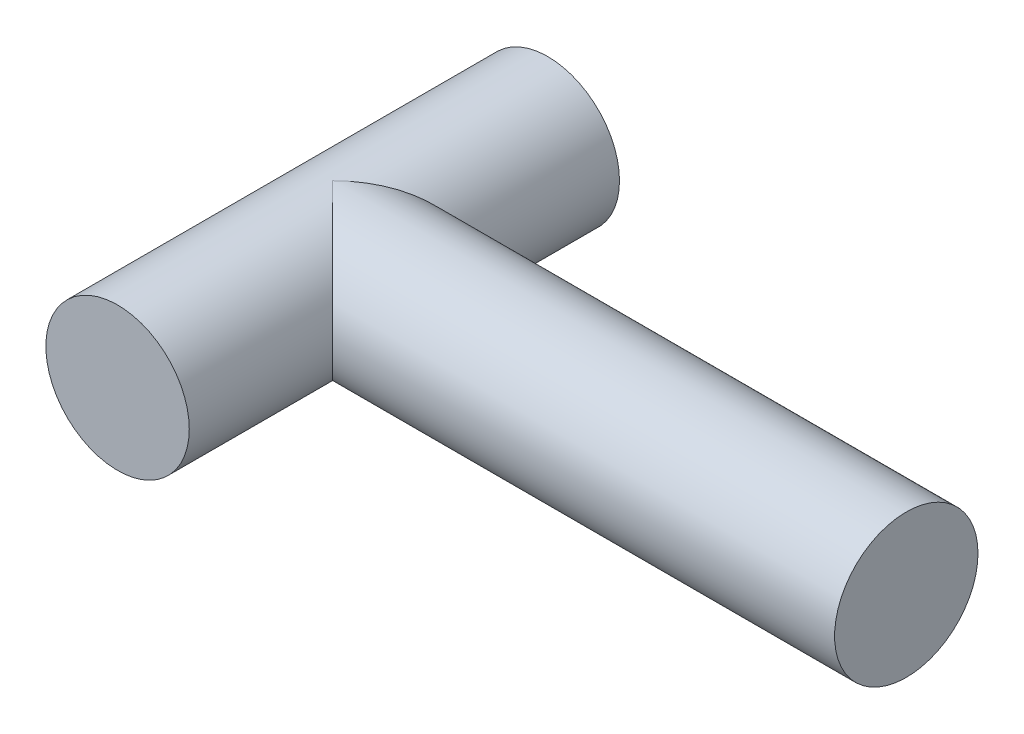
ISO-10303-21;
HEADER;
FILE_DESCRIPTION(('STEP AP214'),'2;1');
FILE_NAME('part.step','',(''),(''),'','','');
FILE_SCHEMA(('AUTOMOTIVE_DESIGN { 1 0 10303 214 1 1 1 1 }'));
ENDSEC;
DATA;
#1=APPLICATION_CONTEXT('core data for automotive mechanical design processes');
#2=APPLICATION_PROTOCOL_DEFINITION('international standard','automotive_design',2000,#1);
#3=PRODUCT_CONTEXT('',#1,'mechanical');
#4=PRODUCT('Part','Part','',(#3));
#5=PRODUCT_RELATED_PRODUCT_CATEGORY('part','',(#4));
#6=PRODUCT_DEFINITION_FORMATION('','',#4);
#7=PRODUCT_DEFINITION_CONTEXT('part definition',#1,'design');
#8=PRODUCT_DEFINITION('design','',#6,#7);
#9=PRODUCT_DEFINITION_SHAPE('','',#8);
#10=(LENGTH_UNIT() NAMED_UNIT(*) SI_UNIT(.MILLI.,.METRE.));
#11=(NAMED_UNIT(*) PLANE_ANGLE_UNIT() SI_UNIT($,.RADIAN.));
#12=(NAMED_UNIT(*) SI_UNIT($,.STERADIAN.) SOLID_ANGLE_UNIT());
#13=UNCERTAINTY_MEASURE_WITH_UNIT(LENGTH_MEASURE(1.E-05),#10,'distance_accuracy_value','');
#14=(GEOMETRIC_REPRESENTATION_CONTEXT(3) GLOBAL_UNCERTAINTY_ASSIGNED_CONTEXT((#13)) GLOBAL_UNIT_ASSIGNED_CONTEXT((#10,
#11,#12)) REPRESENTATION_CONTEXT('',''));
#15=CARTESIAN_POINT('',(0.,0.,0.));
#16=DIRECTION('',(0.,0.,1.));
#17=DIRECTION('',(1.,0.,0.));
#18=AXIS2_PLACEMENT_3D('',#15,#16,#17);
#19=CARTESIAN_POINT('',(0.,0.,22.5));
#20=DIRECTION('',(0.,0.,-1.));
#21=DIRECTION('',(-1.,0.,0.));
#22=AXIS2_PLACEMENT_3D('',#19,#20,#21);
#23=CYLINDRICAL_SURFACE('',#22,7.5);
#24=CARTESIAN_POINT('',(0.,0.,-22.5));
#25=DIRECTION('',(0.,0.,1.));
#26=DIRECTION('',(1.,0.,0.));
#27=AXIS2_PLACEMENT_3D('',#24,#25,#26);
#28=CIRCLE('',#27,7.5);
#29=CARTESIAN_POINT('',(7.5,0.,-22.5));
#30=VERTEX_POINT('',#29);
#31=EDGE_CURVE('E65',#30,#30,#28,.T.);
#32=ORIENTED_EDGE('',*,*,#31,.T.);
#33=EDGE_LOOP('',(#32));
#34=FACE_BOUND('',#33,.T.);
#35=CARTESIAN_POINT('',(0.,0.,22.5));
#36=DIRECTION('',(0.,0.,1.));
#37=DIRECTION('',(1.,0.,0.));
#38=AXIS2_PLACEMENT_3D('',#35,#36,#37);
#39=CIRCLE('',#38,7.5);
#40=CARTESIAN_POINT('',(7.5,0.,22.5));
#41=VERTEX_POINT('',#40);
#42=EDGE_CURVE('E62',#41,#41,#39,.T.);
#43=ORIENTED_EDGE('',*,*,#42,.F.);
#44=EDGE_LOOP('',(#43));
#45=FACE_BOUND('',#44,.T.);
#46=CARTESIAN_POINT('',(0.,0.,0.));
#47=DIRECTION('',(-0.707106781186548,0.,-0.707106781186547));
#48=DIRECTION('',(0.707106781186548,0.,-0.707106781186547));
#49=AXIS2_PLACEMENT_3D('',#46,#47,#48);
#50=ELLIPSE('',#49,10.6066017177982,7.5);
#51=CARTESIAN_POINT('',(0.,-7.5,0.));
#52=VERTEX_POINT('',#51);
#53=CARTESIAN_POINT('',(0.,7.5,0.));
#54=VERTEX_POINT('',#53);
#55=EDGE_CURVE('E11',#52,#54,#50,.F.);
#56=ORIENTED_EDGE('',*,*,#55,.F.);
#57=CARTESIAN_POINT('',(0.,0.,0.));
#58=DIRECTION('',(0.707106781186548,0.,-0.707106781186547));
#59=DIRECTION('',(-0.707106781186548,0.,-0.707106781186547));
#60=AXIS2_PLACEMENT_3D('',#57,#58,#59);
#61=ELLIPSE('',#60,10.6066017177982,7.5);
#62=EDGE_CURVE('E53',#54,#52,#61,.T.);
#63=ORIENTED_EDGE('',*,*,#62,.F.);
#64=EDGE_LOOP('',(#56,#63));
#65=FACE_BOUND('',#64,.T.);
#66=ADVANCED_FACE('F45',(#34,#45,#65),#23,.T.);
#67=CARTESIAN_POINT('',(0.,0.,22.5));
#68=DIRECTION('',(0.,0.,1.));
#69=DIRECTION('',(1.,0.,0.));
#70=AXIS2_PLACEMENT_3D('',#67,#68,#69);
#71=PLANE('',#70);
#72=ORIENTED_EDGE('',*,*,#42,.T.);
#73=EDGE_LOOP('',(#72));
#74=FACE_BOUND('',#73,.T.);
#75=ADVANCED_FACE('F87',(#74),#71,.T.);
#76=CARTESIAN_POINT('',(0.,0.,-22.5));
#77=DIRECTION('',(0.,0.,1.));
#78=DIRECTION('',(1.,0.,0.));
#79=AXIS2_PLACEMENT_3D('',#76,#77,#78);
#80=PLANE('',#79);
#81=ORIENTED_EDGE('',*,*,#31,.F.);
#82=EDGE_LOOP('',(#81));
#83=FACE_BOUND('',#82,.T.);
#84=ADVANCED_FACE('F79',(#83),#80,.F.);
#85=CARTESIAN_POINT('',(60.,0.,0.));
#86=DIRECTION('',(-1.,0.,0.));
#87=DIRECTION('',(0.,0.,1.));
#88=AXIS2_PLACEMENT_3D('',#85,#86,#87);
#89=CYLINDRICAL_SURFACE('',#88,7.5);
#90=CARTESIAN_POINT('',(60.,0.,0.));
#91=DIRECTION('',(1.,0.,0.));
#92=DIRECTION('',(0.,0.,-1.));
#93=AXIS2_PLACEMENT_3D('',#90,#91,#92);
#94=CIRCLE('',#93,7.5);
#95=CARTESIAN_POINT('',(60.,0.,-7.5));
#96=VERTEX_POINT('',#95);
#97=EDGE_CURVE('E70',#96,#96,#94,.T.);
#98=ORIENTED_EDGE('',*,*,#97,.F.);
#99=EDGE_LOOP('',(#98));
#100=FACE_BOUND('',#99,.T.);
#101=ORIENTED_EDGE('',*,*,#62,.T.);
#102=ORIENTED_EDGE('',*,*,#55,.T.);
#103=EDGE_LOOP('',(#101,#102));
#104=FACE_BOUND('',#103,.T.);
#105=ADVANCED_FACE('F60',(#100,#104),#89,.T.);
#106=CARTESIAN_POINT('',(60.,0.,0.));
#107=DIRECTION('',(1.,0.,0.));
#108=DIRECTION('',(0.,0.,-1.));
#109=AXIS2_PLACEMENT_3D('',#106,#107,#108);
#110=PLANE('',#109);
#111=ORIENTED_EDGE('',*,*,#97,.T.);
#112=EDGE_LOOP('',(#111));
#113=FACE_BOUND('',#112,.T.);
#114=ADVANCED_FACE('F76',(#113),#110,.T.);
#115=CLOSED_SHELL('',(#66,#75,#84,#105,#114));
#116=MANIFOLD_SOLID_BREP('B2',#115);
#117=ADVANCED_BREP_SHAPE_REPRESENTATION('',(#18,#116),#14);
#118=SHAPE_DEFINITION_REPRESENTATION(#9,#117);
ENDSEC;
END-ISO-10303-21;
